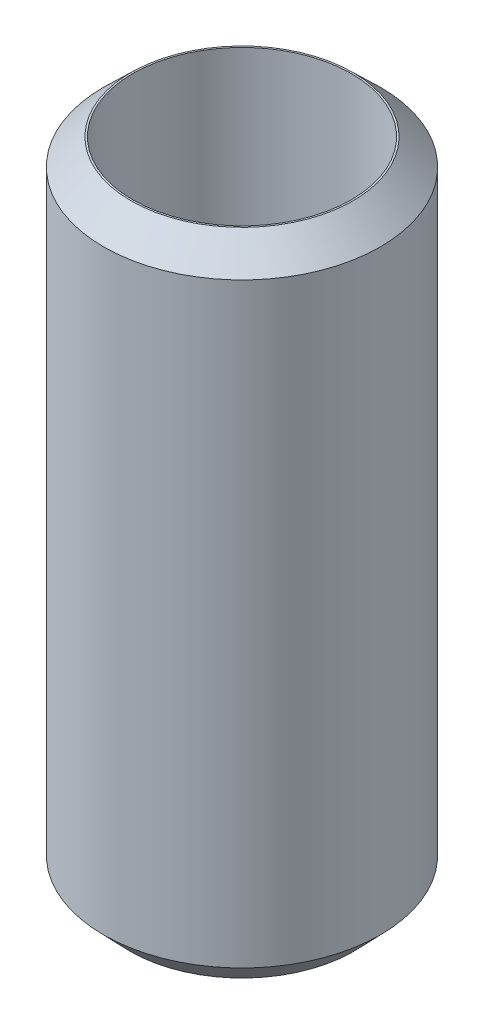
ISO-10303-21;
HEADER;
FILE_DESCRIPTION(('STEP AP214'),'2;1');
FILE_NAME('part.step','',(''),(''),'','','');
FILE_SCHEMA(('AUTOMOTIVE_DESIGN { 1 0 10303 214 1 1 1 1 }'));
ENDSEC;
DATA;
#1=APPLICATION_CONTEXT('core data for automotive mechanical design processes');
#2=APPLICATION_PROTOCOL_DEFINITION('international standard','automotive_design',2000,#1);
#3=PRODUCT_CONTEXT('',#1,'mechanical');
#4=PRODUCT('Part','Part','',(#3));
#5=PRODUCT_RELATED_PRODUCT_CATEGORY('part','',(#4));
#6=PRODUCT_DEFINITION_FORMATION('','',#4);
#7=PRODUCT_DEFINITION_CONTEXT('part definition',#1,'design');
#8=PRODUCT_DEFINITION('design','',#6,#7);
#9=PRODUCT_DEFINITION_SHAPE('','',#8);
#10=(LENGTH_UNIT() NAMED_UNIT(*) SI_UNIT(.MILLI.,.METRE.));
#11=(NAMED_UNIT(*) PLANE_ANGLE_UNIT() SI_UNIT($,.RADIAN.));
#12=(NAMED_UNIT(*) SI_UNIT($,.STERADIAN.) SOLID_ANGLE_UNIT());
#13=UNCERTAINTY_MEASURE_WITH_UNIT(LENGTH_MEASURE(1.E-05),#10,'distance_accuracy_value','');
#14=(GEOMETRIC_REPRESENTATION_CONTEXT(3) GLOBAL_UNCERTAINTY_ASSIGNED_CONTEXT((#13)) GLOBAL_UNIT_ASSIGNED_CONTEXT((#10,
#11,#12)) REPRESENTATION_CONTEXT('',''));
#15=CARTESIAN_POINT('',(0.,0.,0.));
#16=DIRECTION('',(0.,0.,1.));
#17=DIRECTION('',(1.,0.,0.));
#18=AXIS2_PLACEMENT_3D('',#15,#16,#17);
#19=CARTESIAN_POINT('',(0.,105.611413283702,0.));
#20=DIRECTION('',(0.,-1.,0.));
#21=DIRECTION('',(0.,0.,-1.));
#22=AXIS2_PLACEMENT_3D('',#19,#20,#21);
#23=CYLINDRICAL_SURFACE('',#22,22.5);
#24=CARTESIAN_POINT('',(0.,101.338632904604,0.));
#25=DIRECTION('',(0.,1.,0.));
#26=DIRECTION('',(0.,0.,1.));
#27=AXIS2_PLACEMENT_3D('',#24,#25,#26);
#28=CIRCLE('',#27,22.5);
#29=CARTESIAN_POINT('',(0.,101.338632904604,-22.5));
#30=VERTEX_POINT('',#29);
#31=EDGE_CURVE('E50',#30,#30,#28,.F.);
#32=CARTESIAN_POINT('',(0.,4.43582198971972,0.));
#33=DIRECTION('',(0.,1.,0.));
#34=DIRECTION('',(0.,0.,1.));
#35=AXIS2_PLACEMENT_3D('',#32,#33,#34);
#36=CIRCLE('',#35,22.5);
#37=CARTESIAN_POINT('',(0.,4.4358219897197,-22.5));
#38=VERTEX_POINT('',#37);
#39=EDGE_CURVE('E51',#38,#38,#36,.T.);
#40=CARTESIAN_POINT('',(0.,101.338632904604,-22.5));
#41=CARTESIAN_POINT('',(0.,100.32922862424,-22.5));
#42=CARTESIAN_POINT('',(0.,99.3198243438771,-22.5));
#43=CARTESIAN_POINT('',(0.,97.3010157831503,-22.5));
#44=CARTESIAN_POINT('',(0.,96.291611502787,-22.5));
#45=CARTESIAN_POINT('',(0.,94.2728029420602,-22.5));
#46=CARTESIAN_POINT('',(0.,93.2633986616968,-22.5));
#47=CARTESIAN_POINT('',(0.,91.2445901009701,-22.5));
#48=CARTESIAN_POINT('',(0.,90.2351858206067,-22.5));
#49=CARTESIAN_POINT('',(0.,88.2163772598799,-22.5));
#50=CARTESIAN_POINT('',(0.,87.2069729795166,-22.5));
#51=CARTESIAN_POINT('',(0.,85.1881644187898,-22.5));
#52=CARTESIAN_POINT('',(0.,84.1787601384264,-22.5));
#53=CARTESIAN_POINT('',(0.,82.1599515776997,-22.5));
#54=CARTESIAN_POINT('',(0.,81.1505472973363,-22.5));
#55=CARTESIAN_POINT('',(0.,79.1317387366096,-22.5));
#56=CARTESIAN_POINT('',(0.,78.1223344562462,-22.5));
#57=CARTESIAN_POINT('',(0.,76.1035258955194,-22.5));
#58=CARTESIAN_POINT('',(0.,75.0941216151561,-22.5));
#59=CARTESIAN_POINT('',(0.,73.0753130544293,-22.5));
#60=CARTESIAN_POINT('',(0.,72.0659087740659,-22.5));
#61=CARTESIAN_POINT('',(0.,70.0471002133392,-22.5));
#62=CARTESIAN_POINT('',(0.,69.0376959329758,-22.5));
#63=CARTESIAN_POINT('',(0.,67.0188873722491,-22.5));
#64=CARTESIAN_POINT('',(0.,66.0094830918857,-22.5));
#65=CARTESIAN_POINT('',(0.,63.9906745311589,-22.5));
#66=CARTESIAN_POINT('',(0.,62.9812702507955,-22.5));
#67=CARTESIAN_POINT('',(0.,60.9624616900688,-22.5));
#68=CARTESIAN_POINT('',(0.,59.9530574097054,-22.5));
#69=CARTESIAN_POINT('',(0.,57.9342488489787,-22.5));
#70=CARTESIAN_POINT('',(0.,56.9248445686153,-22.5));
#71=CARTESIAN_POINT('',(0.,54.9060360078885,-22.5));
#72=CARTESIAN_POINT('',(0.,53.8966317275252,-22.5));
#73=CARTESIAN_POINT('',(0.,51.8778231667984,-22.5));
#74=CARTESIAN_POINT('',(0.,50.868418886435,-22.5));
#75=CARTESIAN_POINT('',(0.,48.8496103257083,-22.5));
#76=CARTESIAN_POINT('',(0.,47.8402060453449,-22.5));
#77=CARTESIAN_POINT('',(0.,45.8213974846181,-22.5));
#78=CARTESIAN_POINT('',(0.,44.8119932042548,-22.5));
#79=CARTESIAN_POINT('',(0.,42.793184643528,-22.5));
#80=CARTESIAN_POINT('',(0.,41.7837803631646,-22.5));
#81=CARTESIAN_POINT('',(0.,39.7649718024379,-22.5));
#82=CARTESIAN_POINT('',(0.,38.7555675220745,-22.5));
#83=CARTESIAN_POINT('',(0.,36.7367589613477,-22.5));
#84=CARTESIAN_POINT('',(0.,35.7273546809844,-22.5));
#85=CARTESIAN_POINT('',(0.,33.7085461202576,-22.5));
#86=CARTESIAN_POINT('',(0.,32.6991418398942,-22.5));
#87=CARTESIAN_POINT('',(0.,30.6803332791675,-22.5));
#88=CARTESIAN_POINT('',(0.,29.6709289988041,-22.5));
#89=CARTESIAN_POINT('',(0.,27.6521204380774,-22.5));
#90=CARTESIAN_POINT('',(0.,26.642716157714,-22.5));
#91=CARTESIAN_POINT('',(0.,24.6239075969872,-22.5));
#92=CARTESIAN_POINT('',(0.,23.6145033166239,-22.5));
#93=CARTESIAN_POINT('',(0.,21.5956947558971,-22.5));
#94=CARTESIAN_POINT('',(0.,20.5862904755337,-22.5));
#95=CARTESIAN_POINT('',(0.,18.567481914807,-22.5));
#96=CARTESIAN_POINT('',(0.,17.5580776344436,-22.5));
#97=CARTESIAN_POINT('',(0.,15.5392690737168,-22.5));
#98=CARTESIAN_POINT('',(0.,14.5298647933535,-22.5));
#99=CARTESIAN_POINT('',(0.,12.5110562326267,-22.5));
#100=CARTESIAN_POINT('',(0.,11.5016519522633,-22.5));
#101=CARTESIAN_POINT('',(0.,9.48284339153659,-22.5));
#102=CARTESIAN_POINT('',(0.,8.47343911117321,-22.5));
#103=CARTESIAN_POINT('',(0.,6.45463055044646,-22.5));
#104=CARTESIAN_POINT('',(0.,5.44522627008308,-22.5));
#105=CARTESIAN_POINT('',(0.,4.4358219897197,-22.5));
#106=B_SPLINE_CURVE_WITH_KNOTS('',3,(#40,#41,#42,#43,#44,#45,#46,#47,#48,#49,#50,#51,#52,#53,
#54,#55,#56,#57,#58,#59,#60,#61,#62,#63,#64,#65,#66,#67,#68,#69,#70,#71,#72,#73,#74,#75,#76,#77,
#78,#79,#80,#81,#82,#83,#84,#85,#86,#87,#88,#89,#90,#91,#92,#93,#94,#95,#96,#97,#98,#99,#100,
#101,#102,#103,#104,#105),.UNSPECIFIED.,.F.,.F.,(4,2,2,2,2,2,2,2,2,2,2,2,2,2,2,2,2,2,2,2,2,2,2,
2,2,2,2,2,2,2,2,2,4),(0.,3.02821284109013,6.05642568218025,9.08463852327038,12.1128513643605,
15.1410642054506,18.1692770465408,21.1974898876309,24.225702728721,27.2539155698111,
30.2821284109013,33.3103412519914,36.3385540930815,39.3667669341717,42.3949797752618,
45.4231926163519,48.4514054574421,51.4796182985322,54.5078311396223,57.5360439807124,
60.5642568218026,63.5924696628927,66.6206825039828,69.648895345073,72.6771081861631,
75.7053210272532,78.7335338683433,81.7617467094335,84.7899595505236,87.8181723916137,
90.8463852327039,93.874598073794,96.9028109148841),.UNSPECIFIED.);
#107=EDGE_CURVE('BSEAM39',#30,#38,#106,.T.);
#108=ORIENTED_EDGE('',*,*,#31,.T.);
#109=ORIENTED_EDGE('',*,*,#39,.T.);
#110=ORIENTED_EDGE('',*,*,#107,.T.);
#111=ORIENTED_EDGE('',*,*,#107,.F.);
#112=EDGE_LOOP('',(#108,#110,#109,#111));
#113=FACE_BOUND('',#112,.T.);
#114=ADVANCED_FACE('F39',(#113),#23,.T.);
#115=CARTESIAN_POINT('',(0.,105.611413283702,0.));
#116=DIRECTION('',(0.,1.,0.));
#117=DIRECTION('',(0.,0.,1.));
#118=AXIS2_PLACEMENT_3D('',#115,#116,#117);
#119=PLANE('',#118);
#120=CARTESIAN_POINT('',(0.,105.611413283702,0.));
#121=DIRECTION('',(0.,1.,0.));
#122=DIRECTION('',(0.,0.,1.));
#123=AXIS2_PLACEMENT_3D('',#120,#121,#122);
#124=CIRCLE('',#123,18.0641780102804);
#125=CARTESIAN_POINT('',(0.,105.611413283702,18.0641780102804));
#126=VERTEX_POINT('',#125);
#127=EDGE_CURVE('E54',#126,#126,#124,.T.);
#128=ORIENTED_EDGE('',*,*,#127,.T.);
#129=EDGE_LOOP('',(#128));
#130=FACE_BOUND('',#129,.T.);
#131=CARTESIAN_POINT('',(0.,105.611413283702,0.));
#132=DIRECTION('',(0.,1.,0.));
#133=DIRECTION('',(0.,0.,1.));
#134=AXIS2_PLACEMENT_3D('',#131,#132,#133);
#135=CIRCLE('',#134,17.7786124085323);
#136=CARTESIAN_POINT('',(0.,105.611413283702,-17.7786124085323));
#137=VERTEX_POINT('',#136);
#138=EDGE_CURVE('E58',#137,#137,#135,.T.);
#139=ORIENTED_EDGE('',*,*,#138,.F.);
#140=EDGE_LOOP('',(#139));
#141=FACE_BOUND('',#140,.T.);
#142=ADVANCED_FACE('F69',(#130,#141),#119,.T.);
#143=CARTESIAN_POINT('',(0.,0.,0.));
#144=DIRECTION('',(0.,1.,0.));
#145=DIRECTION('',(0.,0.,1.));
#146=AXIS2_PLACEMENT_3D('',#143,#144,#145);
#147=PLANE('',#146);
#148=CARTESIAN_POINT('',(0.,0.,0.));
#149=DIRECTION('',(0.,1.,0.));
#150=DIRECTION('',(0.,0.,1.));
#151=AXIS2_PLACEMENT_3D('',#148,#149,#150);
#152=CIRCLE('',#151,18.227219620902);
#153=CARTESIAN_POINT('',(0.,0.,18.227219620902));
#154=VERTEX_POINT('',#153);
#155=EDGE_CURVE('E10',#154,#154,#152,.F.);
#156=ORIENTED_EDGE('',*,*,#155,.T.);
#157=EDGE_LOOP('',(#156));
#158=FACE_BOUND('',#157,.T.);
#159=CARTESIAN_POINT('',(0.,0.,0.));
#160=DIRECTION('',(0.,1.,0.));
#161=DIRECTION('',(0.,0.,1.));
#162=AXIS2_PLACEMENT_3D('',#159,#160,#161);
#163=CIRCLE('',#162,17.7786124085323);
#164=CARTESIAN_POINT('',(0.,0.,-17.7786124085323));
#165=VERTEX_POINT('',#164);
#166=EDGE_CURVE('E63',#165,#165,#163,.T.);
#167=ORIENTED_EDGE('',*,*,#166,.T.);
#168=EDGE_LOOP('',(#167));
#169=FACE_BOUND('',#168,.T.);
#170=ADVANCED_FACE('F75',(#158,#169),#147,.F.);
#171=CARTESIAN_POINT('',(0.,105.611413283702,0.));
#172=DIRECTION('',(0.,-1.,0.));
#173=DIRECTION('',(0.,0.,-1.));
#174=AXIS2_PLACEMENT_3D('',#171,#172,#173);
#175=CYLINDRICAL_SURFACE('',#174,17.7786124085323);
#176=CARTESIAN_POINT('',(0.,105.611413283702,-17.7786124085323));
#177=CARTESIAN_POINT('',(0.,104.51129439533,-17.7786124085323));
#178=CARTESIAN_POINT('',(0.,103.411175506958,-17.7786124085323));
#179=CARTESIAN_POINT('',(0.,101.210937730214,-17.7786124085323));
#180=CARTESIAN_POINT('',(0.,100.110818841842,-17.7786124085323));
#181=CARTESIAN_POINT('',(0.,97.9105810650986,-17.7786124085323));
#182=CARTESIAN_POINT('',(0.,96.8104621767267,-17.7786124085323));
#183=CARTESIAN_POINT('',(0.,94.6102243999829,-17.7786124085323));
#184=CARTESIAN_POINT('',(0.,93.510105511611,-17.7786124085323));
#185=CARTESIAN_POINT('',(0.,91.3098677348672,-17.7786124085323));
#186=CARTESIAN_POINT('',(0.,90.2097488464953,-17.7786124085323));
#187=CARTESIAN_POINT('',(0.,88.0095110697515,-17.7786124085323));
#188=CARTESIAN_POINT('',(0.,86.9093921813796,-17.7786124085323));
#189=CARTESIAN_POINT('',(0.,84.7091544046358,-17.7786124085323));
#190=CARTESIAN_POINT('',(0.,83.6090355162639,-17.7786124085323));
#191=CARTESIAN_POINT('',(0.,81.4087977395201,-17.7786124085323));
#192=CARTESIAN_POINT('',(0.,80.3086788511482,-17.7786124085323));
#193=CARTESIAN_POINT('',(0.,78.1084410744045,-17.7786124085323));
#194=CARTESIAN_POINT('',(0.,77.0083221860326,-17.7786124085323));
#195=CARTESIAN_POINT('',(0.,74.8080844092888,-17.7786124085323));
#196=CARTESIAN_POINT('',(0.,73.7079655209169,-17.7786124085323));
#197=CARTESIAN_POINT('',(0.,71.5077277441731,-17.7786124085323));
#198=CARTESIAN_POINT('',(0.,70.4076088558012,-17.7786124085323));
#199=CARTESIAN_POINT('',(0.,68.2073710790574,-17.7786124085323));
#200=CARTESIAN_POINT('',(0.,67.1072521906855,-17.7786124085323));
#201=CARTESIAN_POINT('',(0.,64.9070144139417,-17.7786124085323));
#202=CARTESIAN_POINT('',(0.,63.8068955255698,-17.7786124085323));
#203=CARTESIAN_POINT('',(0.,61.6066577488261,-17.7786124085323));
#204=CARTESIAN_POINT('',(0.,60.5065388604542,-17.7786124085323));
#205=CARTESIAN_POINT('',(0.,58.3063010837104,-17.7786124085323));
#206=CARTESIAN_POINT('',(0.,57.2061821953385,-17.7786124085323));
#207=CARTESIAN_POINT('',(0.,55.0059444185947,-17.7786124085323));
#208=CARTESIAN_POINT('',(0.,53.9058255302228,-17.7786124085323));
#209=CARTESIAN_POINT('',(0.,51.705587753479,-17.7786124085323));
#210=CARTESIAN_POINT('',(0.,50.6054688651071,-17.7786124085323));
#211=CARTESIAN_POINT('',(0.,48.4052310883633,-17.7786124085323));
#212=CARTESIAN_POINT('',(0.,47.3051121999914,-17.7786124085323));
#213=CARTESIAN_POINT('',(0.,45.1048744232477,-17.7786124085323));
#214=CARTESIAN_POINT('',(0.,44.0047555348758,-17.7786124085323));
#215=CARTESIAN_POINT('',(0.,41.804517758132,-17.7786124085323));
#216=CARTESIAN_POINT('',(0.,40.7043988697601,-17.7786124085323));
#217=CARTESIAN_POINT('',(0.,38.5041610930163,-17.7786124085323));
#218=CARTESIAN_POINT('',(0.,37.4040422046444,-17.7786124085323));
#219=CARTESIAN_POINT('',(0.,35.2038044279006,-17.7786124085323));
#220=CARTESIAN_POINT('',(0.,34.1036855395287,-17.7786124085323));
#221=CARTESIAN_POINT('',(0.,31.9034477627849,-17.7786124085323));
#222=CARTESIAN_POINT('',(0.,30.803328874413,-17.7786124085323));
#223=CARTESIAN_POINT('',(0.,28.6030910976692,-17.7786124085323));
#224=CARTESIAN_POINT('',(0.,27.5029722092974,-17.7786124085323));
#225=CARTESIAN_POINT('',(0.,25.3027344325536,-17.7786124085323));
#226=CARTESIAN_POINT('',(0.,24.2026155441817,-17.7786124085323));
#227=CARTESIAN_POINT('',(0.,22.0023777674379,-17.7786124085323));
#228=CARTESIAN_POINT('',(0.,20.902258879066,-17.7786124085323));
#229=CARTESIAN_POINT('',(0.,18.7020211023222,-17.7786124085323));
#230=CARTESIAN_POINT('',(0.,17.6019022139503,-17.7786124085323));
#231=CARTESIAN_POINT('',(0.,15.4016644372065,-17.7786124085323));
#232=CARTESIAN_POINT('',(0.,14.3015455488346,-17.7786124085323));
#233=CARTESIAN_POINT('',(0.,12.1013077720908,-17.7786124085323));
#234=CARTESIAN_POINT('',(0.,11.0011888837189,-17.7786124085323));
#235=CARTESIAN_POINT('',(0.,8.80095110697515,-17.7786124085323));
#236=CARTESIAN_POINT('',(0.,7.70083221860326,-17.7786124085323));
#237=CARTESIAN_POINT('',(0.,5.50059444185947,-17.7786124085323));
#238=CARTESIAN_POINT('',(0.,4.40047555348758,-17.7786124085323));
#239=CARTESIAN_POINT('',(0.,2.20023777674379,-17.7786124085323));
#240=CARTESIAN_POINT('',(0.,1.1001188883719,-17.7786124085323));
#241=CARTESIAN_POINT('',(0.,0.,-17.7786124085323));
#242=B_SPLINE_CURVE_WITH_KNOTS('',3,(#176,#177,#178,#179,#180,#181,#182,#183,#184,#185,#186,
#187,#188,#189,#190,#191,#192,#193,#194,#195,#196,#197,#198,#199,#200,#201,#202,#203,#204,#205,
#206,#207,#208,#209,#210,#211,#212,#213,#214,#215,#216,#217,#218,#219,#220,#221,#222,#223,#224,
#225,#226,#227,#228,#229,#230,#231,#232,#233,#234,#235,#236,#237,#238,#239,#240,#241),
.UNSPECIFIED.,.F.,.F.,(4,2,2,2,2,2,2,2,2,2,2,2,2,2,2,2,2,2,2,2,2,2,2,2,2,2,2,2,2,2,2,2,4),(0.,
3.30035666511569,6.60071333023136,9.90106999534705,13.2014266604627,16.5017833255784,
19.8021399906941,23.1024966558098,26.4028533209255,29.7032099860411,33.0035666511568,
36.3039233162725,39.6042799813882,42.9046366465039,46.2049933116195,49.5053499767352,
52.8057066418509,56.1060633069666,59.4064199720823,62.7067766371979,66.0071333023136,
69.3074899674293,72.607846632545,75.9082032976607,79.2085599627764,82.508916627892,
85.8092732930077,89.1096299581234,92.4099866232391,95.7103432883548,99.0106999534704,
102.311056618586,105.611413283702),.UNSPECIFIED.);
#243=EDGE_CURVE('BSEAM70',#137,#165,#242,.T.);
#244=ORIENTED_EDGE('',*,*,#138,.T.);
#245=ORIENTED_EDGE('',*,*,#166,.F.);
#246=ORIENTED_EDGE('',*,*,#243,.T.);
#247=ORIENTED_EDGE('',*,*,#243,.F.);
#248=EDGE_LOOP('',(#244,#246,#245,#247));
#249=FACE_BOUND('',#248,.T.);
#250=ADVANCED_FACE('F70',(#249),#175,.F.);
#251=CARTESIAN_POINT('',(0.,105.611413283702,0.));
#252=DIRECTION('',(0.,-1.,0.));
#253=DIRECTION('',(0.,0.,-1.));
#254=AXIS2_PLACEMENT_3D('',#251,#252,#253);
#255=CONICAL_SURFACE('',#254,18.0641780102804,0.804117879662224);
#256=ORIENTED_EDGE('',*,*,#31,.F.);
#257=EDGE_LOOP('',(#256));
#258=FACE_BOUND('',#257,.T.);
#259=ORIENTED_EDGE('',*,*,#127,.F.);
#260=EDGE_LOOP('',(#259));
#261=FACE_BOUND('',#260,.T.);
#262=ADVANCED_FACE('F81',(#258,#261),#255,.T.);
#263=CARTESIAN_POINT('',(0.,4.43582198971972,0.));
#264=DIRECTION('',(0.,1.,0.));
#265=DIRECTION('',(0.,0.,1.));
#266=AXIS2_PLACEMENT_3D('',#263,#264,#265);
#267=CONICAL_SURFACE('',#266,22.5,0.766678447132674);
#268=ORIENTED_EDGE('',*,*,#155,.F.);
#269=EDGE_LOOP('',(#268));
#270=FACE_BOUND('',#269,.T.);
#271=ORIENTED_EDGE('',*,*,#39,.F.);
#272=EDGE_LOOP('',(#271));
#273=FACE_BOUND('',#272,.T.);
#274=ADVANCED_FACE('F45',(#270,#273),#267,.T.);
#275=CLOSED_SHELL('',(#114,#142,#170,#250,#262,#274));
#276=MANIFOLD_SOLID_BREP('B2',#275);
#277=ADVANCED_BREP_SHAPE_REPRESENTATION('',(#18,#276),#14);
#278=SHAPE_DEFINITION_REPRESENTATION(#9,#277);
ENDSEC;
END-ISO-10303-21;
